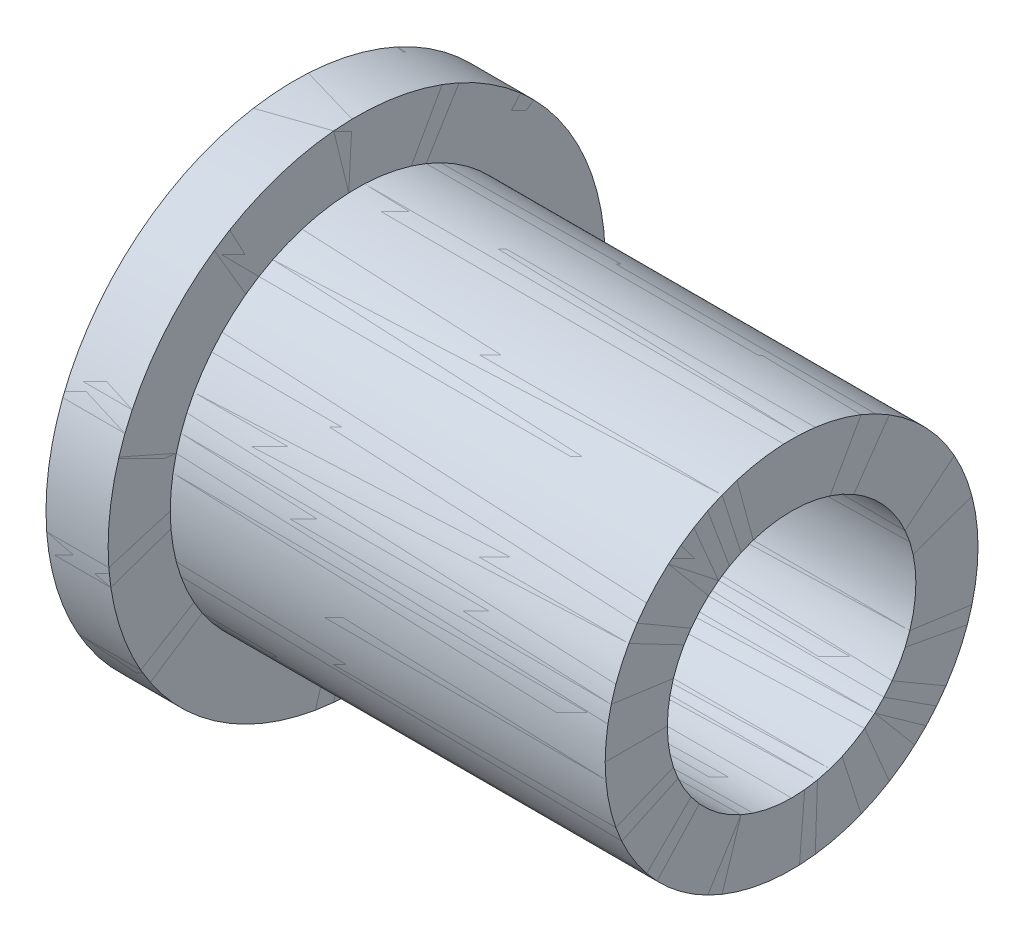
ISO-10303-21;
HEADER;
FILE_DESCRIPTION(('STEP AP214'),'2;1');
FILE_NAME('part.step','',(''),(''),'','','');
FILE_SCHEMA(('AUTOMOTIVE_DESIGN { 1 0 10303 214 1 1 1 1 }'));
ENDSEC;
DATA;
#1=APPLICATION_CONTEXT('core data for automotive mechanical design processes');
#2=APPLICATION_PROTOCOL_DEFINITION('international standard','automotive_design',2000,#1);
#3=PRODUCT_CONTEXT('',#1,'mechanical');
#4=PRODUCT('Part','Part','',(#3));
#5=PRODUCT_RELATED_PRODUCT_CATEGORY('part','',(#4));
#6=PRODUCT_DEFINITION_FORMATION('','',#4);
#7=PRODUCT_DEFINITION_CONTEXT('part definition',#1,'design');
#8=PRODUCT_DEFINITION('design','',#6,#7);
#9=PRODUCT_DEFINITION_SHAPE('','',#8);
#10=(LENGTH_UNIT() NAMED_UNIT(*) SI_UNIT(.MILLI.,.METRE.));
#11=(NAMED_UNIT(*) PLANE_ANGLE_UNIT() SI_UNIT($,.RADIAN.));
#12=(NAMED_UNIT(*) SI_UNIT($,.STERADIAN.) SOLID_ANGLE_UNIT());
#13=UNCERTAINTY_MEASURE_WITH_UNIT(LENGTH_MEASURE(1.E-05),#10,'distance_accuracy_value','');
#14=(GEOMETRIC_REPRESENTATION_CONTEXT(3) GLOBAL_UNCERTAINTY_ASSIGNED_CONTEXT((#13)) GLOBAL_UNIT_ASSIGNED_CONTEXT((#10,
#11,#12)) REPRESENTATION_CONTEXT('',''));
#15=CARTESIAN_POINT('',(0.,0.,0.));
#16=DIRECTION('',(0.,0.,1.));
#17=DIRECTION('',(1.,0.,0.));
#18=AXIS2_PLACEMENT_3D('',#15,#16,#17);
#19=CARTESIAN_POINT('',(0.,0.,0.));
#20=DIRECTION('',(-1.,0.,0.));
#21=DIRECTION('',(0.,0.,1.));
#22=AXIS2_PLACEMENT_3D('',#19,#20,#21);
#23=CYLINDRICAL_SURFACE('',#22,3.175);
#24=CARTESIAN_POINT('',(0.,0.,0.));
#25=DIRECTION('',(-1.,0.,0.));
#26=DIRECTION('',(0.,0.,1.));
#27=AXIS2_PLACEMENT_3D('',#24,#25,#26);
#28=CIRCLE('',#27,3.175);
#29=CARTESIAN_POINT('',(0.,0.,3.175));
#30=VERTEX_POINT('',#29);
#31=EDGE_CURVE('E60',#30,#30,#28,.T.);
#32=ORIENTED_EDGE('',*,*,#31,.T.);
#33=EDGE_LOOP('',(#32));
#34=FACE_BOUND('',#33,.T.);
#35=CARTESIAN_POINT('',(12.7,0.,0.));
#36=DIRECTION('',(-1.,0.,0.));
#37=DIRECTION('',(0.,0.,1.));
#38=AXIS2_PLACEMENT_3D('',#35,#36,#37);
#39=CIRCLE('',#38,3.175);
#40=CARTESIAN_POINT('',(12.7,0.,3.175));
#41=VERTEX_POINT('',#40);
#42=EDGE_CURVE('E11',#41,#41,#39,.T.);
#43=ORIENTED_EDGE('',*,*,#42,.F.);
#44=EDGE_LOOP('',(#43));
#45=FACE_BOUND('',#44,.T.);
#46=ADVANCED_FACE('F38',(#34,#45),#23,.F.);
#47=CARTESIAN_POINT('',(12.7,0.,3.175));
#48=DIRECTION('',(1.,0.,0.));
#49=DIRECTION('',(0.,0.,-1.));
#50=AXIS2_PLACEMENT_3D('',#47,#48,#49);
#51=PLANE('',#50);
#52=ORIENTED_EDGE('',*,*,#42,.T.);
#53=EDGE_LOOP('',(#52));
#54=FACE_BOUND('',#53,.T.);
#55=CARTESIAN_POINT('',(12.7,0.,0.));
#56=DIRECTION('',(-1.,0.,0.));
#57=DIRECTION('',(0.,0.,1.));
#58=AXIS2_PLACEMENT_3D('',#55,#56,#57);
#59=CIRCLE('',#58,4.7625);
#60=CARTESIAN_POINT('',(12.7,0.,4.7625));
#61=VERTEX_POINT('',#60);
#62=EDGE_CURVE('E44',#61,#61,#59,.T.);
#63=ORIENTED_EDGE('',*,*,#62,.F.);
#64=EDGE_LOOP('',(#63));
#65=FACE_BOUND('',#64,.T.);
#66=ADVANCED_FACE('F78',(#54,#65),#51,.T.);
#67=CARTESIAN_POINT('',(0.,0.,0.));
#68=DIRECTION('',(-1.,0.,0.));
#69=DIRECTION('',(0.,0.,1.));
#70=AXIS2_PLACEMENT_3D('',#67,#68,#69);
#71=CYLINDRICAL_SURFACE('',#70,4.7625);
#72=ORIENTED_EDGE('',*,*,#62,.T.);
#73=EDGE_LOOP('',(#72));
#74=FACE_BOUND('',#73,.T.);
#75=CARTESIAN_POINT('',(1.5875,0.,0.));
#76=DIRECTION('',(-1.,0.,0.));
#77=DIRECTION('',(0.,0.,1.));
#78=AXIS2_PLACEMENT_3D('',#75,#76,#77);
#79=CIRCLE('',#78,4.7625);
#80=CARTESIAN_POINT('',(1.5875,0.,4.7625));
#81=VERTEX_POINT('',#80);
#82=EDGE_CURVE('E48',#81,#81,#79,.T.);
#83=ORIENTED_EDGE('',*,*,#82,.F.);
#84=EDGE_LOOP('',(#83));
#85=FACE_BOUND('',#84,.T.);
#86=ADVANCED_FACE('F82',(#74,#85),#71,.T.);
#87=CARTESIAN_POINT('',(1.5875,0.,4.7625));
#88=DIRECTION('',(1.,0.,0.));
#89=DIRECTION('',(0.,0.,-1.));
#90=AXIS2_PLACEMENT_3D('',#87,#88,#89);
#91=PLANE('',#90);
#92=ORIENTED_EDGE('',*,*,#82,.T.);
#93=EDGE_LOOP('',(#92));
#94=FACE_BOUND('',#93,.T.);
#95=CARTESIAN_POINT('',(1.5875,0.,0.));
#96=DIRECTION('',(-1.,0.,0.));
#97=DIRECTION('',(0.,0.,1.));
#98=AXIS2_PLACEMENT_3D('',#95,#96,#97);
#99=CIRCLE('',#98,6.35);
#100=CARTESIAN_POINT('',(1.5875,0.,6.35));
#101=VERTEX_POINT('',#100);
#102=EDGE_CURVE('E52',#101,#101,#99,.T.);
#103=ORIENTED_EDGE('',*,*,#102,.F.);
#104=EDGE_LOOP('',(#103));
#105=FACE_BOUND('',#104,.T.);
#106=ADVANCED_FACE('F74',(#94,#105),#91,.T.);
#107=CARTESIAN_POINT('',(0.,0.,0.));
#108=DIRECTION('',(-1.,0.,0.));
#109=DIRECTION('',(0.,0.,1.));
#110=AXIS2_PLACEMENT_3D('',#107,#108,#109);
#111=CYLINDRICAL_SURFACE('',#110,6.35);
#112=ORIENTED_EDGE('',*,*,#102,.T.);
#113=EDGE_LOOP('',(#112));
#114=FACE_BOUND('',#113,.T.);
#115=CARTESIAN_POINT('',(0.,0.,0.));
#116=DIRECTION('',(-1.,0.,0.));
#117=DIRECTION('',(0.,0.,1.));
#118=AXIS2_PLACEMENT_3D('',#115,#116,#117);
#119=CIRCLE('',#118,6.35);
#120=CARTESIAN_POINT('',(0.,0.,6.35));
#121=VERTEX_POINT('',#120);
#122=EDGE_CURVE('E57',#121,#121,#119,.T.);
#123=ORIENTED_EDGE('',*,*,#122,.F.);
#124=EDGE_LOOP('',(#123));
#125=FACE_BOUND('',#124,.T.);
#126=ADVANCED_FACE('F68',(#114,#125),#111,.T.);
#127=CARTESIAN_POINT('',(0.,0.,6.35));
#128=DIRECTION('',(-1.,0.,0.));
#129=DIRECTION('',(0.,0.,1.));
#130=AXIS2_PLACEMENT_3D('',#127,#128,#129);
#131=PLANE('',#130);
#132=ORIENTED_EDGE('',*,*,#122,.T.);
#133=EDGE_LOOP('',(#132));
#134=FACE_BOUND('',#133,.T.);
#135=ORIENTED_EDGE('',*,*,#31,.F.);
#136=EDGE_LOOP('',(#135));
#137=FACE_BOUND('',#136,.T.);
#138=ADVANCED_FACE('F66',(#134,#137),#131,.T.);
#139=CLOSED_SHELL('',(#46,#66,#86,#106,#126,#138));
#140=MANIFOLD_SOLID_BREP('B2',#139);
#141=CARTESIAN_POINT('',(0.,0.,-6.35));
#142=DIRECTION('',(1.,0.,0.));
#143=DIRECTION('',(0.,0.,-1.));
#144=AXIS2_PLACEMENT_3D('',#141,#142,#143);
#145=PLANE('',#144);
#146=CARTESIAN_POINT('',(0.,0.,0.));
#147=DIRECTION('',(-1.,0.,0.));
#148=DIRECTION('',(0.,0.,1.));
#149=AXIS2_PLACEMENT_3D('',#146,#147,#148);
#150=CIRCLE('',#149,3.175);
#151=CARTESIAN_POINT('',(0.,0.,3.175));
#152=VERTEX_POINT('',#151);
#153=EDGE_CURVE('E37',#152,#152,#150,.T.);
#154=ORIENTED_EDGE('',*,*,#153,.F.);
#155=EDGE_LOOP('',(#154));
#156=FACE_BOUND('',#155,.T.);
#157=CARTESIAN_POINT('',(0.,0.,0.));
#158=DIRECTION('',(-1.,0.,0.));
#159=DIRECTION('',(0.,0.,1.));
#160=AXIS2_PLACEMENT_3D('',#157,#158,#159);
#161=CIRCLE('',#160,6.35);
#162=CARTESIAN_POINT('',(0.,0.,6.35));
#163=VERTEX_POINT('',#162);
#164=EDGE_CURVE('E151',#163,#163,#161,.T.);
#165=ORIENTED_EDGE('',*,*,#164,.T.);
#166=EDGE_LOOP('',(#165));
#167=FACE_BOUND('',#166,.T.);
#168=ADVANCED_FACE('F129',(#156,#167),#145,.F.);
#169=CARTESIAN_POINT('',(0.,0.,0.));
#170=DIRECTION('',(-1.,0.,0.));
#171=DIRECTION('',(0.,0.,1.));
#172=AXIS2_PLACEMENT_3D('',#169,#170,#171);
#173=CYLINDRICAL_SURFACE('',#172,3.175);
#174=CARTESIAN_POINT('',(12.7,0.,0.));
#175=DIRECTION('',(-1.,0.,0.));
#176=DIRECTION('',(0.,0.,1.));
#177=AXIS2_PLACEMENT_3D('',#174,#175,#176);
#178=CIRCLE('',#177,3.175);
#179=CARTESIAN_POINT('',(12.7,0.,3.175));
#180=VERTEX_POINT('',#179);
#181=EDGE_CURVE('E135',#180,#180,#178,.T.);
#182=ORIENTED_EDGE('',*,*,#181,.F.);
#183=EDGE_LOOP('',(#182));
#184=FACE_BOUND('',#183,.T.);
#185=ORIENTED_EDGE('',*,*,#153,.T.);
#186=EDGE_LOOP('',(#185));
#187=FACE_BOUND('',#186,.T.);
#188=ADVANCED_FACE('F176',(#184,#187),#173,.F.);
#189=CARTESIAN_POINT('',(12.7,0.,-3.175));
#190=DIRECTION('',(-1.,0.,0.));
#191=DIRECTION('',(0.,0.,1.));
#192=AXIS2_PLACEMENT_3D('',#189,#190,#191);
#193=PLANE('',#192);
#194=CARTESIAN_POINT('',(12.7,0.,0.));
#195=DIRECTION('',(-1.,0.,0.));
#196=DIRECTION('',(0.,0.,1.));
#197=AXIS2_PLACEMENT_3D('',#194,#195,#196);
#198=CIRCLE('',#197,4.7625);
#199=CARTESIAN_POINT('',(12.7,0.,4.7625));
#200=VERTEX_POINT('',#199);
#201=EDGE_CURVE('E139',#200,#200,#198,.T.);
#202=ORIENTED_EDGE('',*,*,#201,.F.);
#203=EDGE_LOOP('',(#202));
#204=FACE_BOUND('',#203,.T.);
#205=ORIENTED_EDGE('',*,*,#181,.T.);
#206=EDGE_LOOP('',(#205));
#207=FACE_BOUND('',#206,.T.);
#208=ADVANCED_FACE('F171',(#204,#207),#193,.F.);
#209=CARTESIAN_POINT('',(0.,0.,0.));
#210=DIRECTION('',(-1.,0.,0.));
#211=DIRECTION('',(0.,0.,1.));
#212=AXIS2_PLACEMENT_3D('',#209,#210,#211);
#213=CYLINDRICAL_SURFACE('',#212,4.7625);
#214=CARTESIAN_POINT('',(1.5875,0.,0.));
#215=DIRECTION('',(-1.,0.,0.));
#216=DIRECTION('',(0.,0.,1.));
#217=AXIS2_PLACEMENT_3D('',#214,#215,#216);
#218=CIRCLE('',#217,4.7625);
#219=CARTESIAN_POINT('',(1.5875,0.,4.7625));
#220=VERTEX_POINT('',#219);
#221=EDGE_CURVE('E143',#220,#220,#218,.T.);
#222=ORIENTED_EDGE('',*,*,#221,.F.);
#223=EDGE_LOOP('',(#222));
#224=FACE_BOUND('',#223,.T.);
#225=ORIENTED_EDGE('',*,*,#201,.T.);
#226=EDGE_LOOP('',(#225));
#227=FACE_BOUND('',#226,.T.);
#228=ADVANCED_FACE('F165',(#224,#227),#213,.T.);
#229=CARTESIAN_POINT('',(1.5875,0.,-4.7625));
#230=DIRECTION('',(-1.,0.,0.));
#231=DIRECTION('',(0.,0.,1.));
#232=AXIS2_PLACEMENT_3D('',#229,#230,#231);
#233=PLANE('',#232);
#234=CARTESIAN_POINT('',(1.5875,0.,0.));
#235=DIRECTION('',(-1.,0.,0.));
#236=DIRECTION('',(0.,0.,1.));
#237=AXIS2_PLACEMENT_3D('',#234,#235,#236);
#238=CIRCLE('',#237,6.35);
#239=CARTESIAN_POINT('',(1.5875,0.,6.35));
#240=VERTEX_POINT('',#239);
#241=EDGE_CURVE('E148',#240,#240,#238,.T.);
#242=ORIENTED_EDGE('',*,*,#241,.F.);
#243=EDGE_LOOP('',(#242));
#244=FACE_BOUND('',#243,.T.);
#245=ORIENTED_EDGE('',*,*,#221,.T.);
#246=EDGE_LOOP('',(#245));
#247=FACE_BOUND('',#246,.T.);
#248=ADVANCED_FACE('F159',(#244,#247),#233,.F.);
#249=CARTESIAN_POINT('',(0.,0.,0.));
#250=DIRECTION('',(-1.,0.,0.));
#251=DIRECTION('',(0.,0.,1.));
#252=AXIS2_PLACEMENT_3D('',#249,#250,#251);
#253=CYLINDRICAL_SURFACE('',#252,6.35);
#254=ORIENTED_EDGE('',*,*,#164,.F.);
#255=EDGE_LOOP('',(#254));
#256=FACE_BOUND('',#255,.T.);
#257=ORIENTED_EDGE('',*,*,#241,.T.);
#258=EDGE_LOOP('',(#257));
#259=FACE_BOUND('',#258,.T.);
#260=ADVANCED_FACE('F156',(#256,#259),#253,.T.);
#261=CLOSED_SHELL('',(#168,#188,#208,#228,#248,#260));
#262=MANIFOLD_SOLID_BREP('B6',#261);
#263=ADVANCED_BREP_SHAPE_REPRESENTATION('',(#18,#140,#262),#14);
#264=SHAPE_DEFINITION_REPRESENTATION(#9,#263);
ENDSEC;
END-ISO-10303-21;
